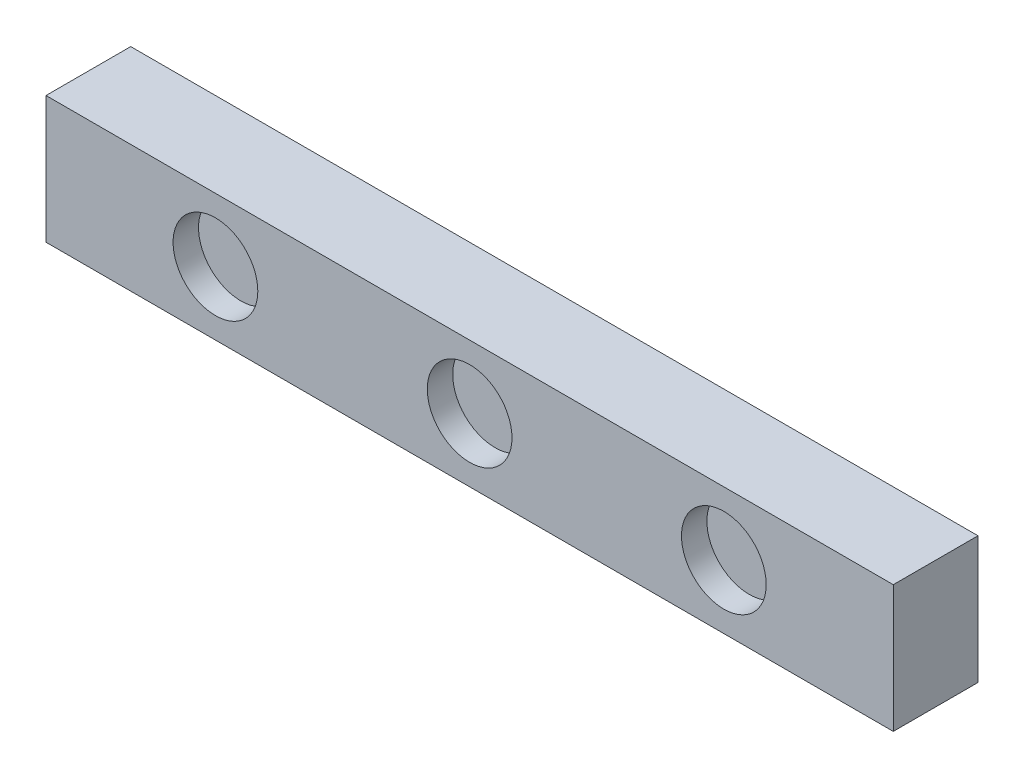
ISO-10303-21;
HEADER;
FILE_DESCRIPTION(('STEP AP214'),'2;1');
FILE_NAME('part.step','',(''),(''),'','','');
FILE_SCHEMA(('AUTOMOTIVE_DESIGN { 1 0 10303 214 1 1 1 1 }'));
ENDSEC;
DATA;
#1=APPLICATION_CONTEXT('core data for automotive mechanical design processes');
#2=APPLICATION_PROTOCOL_DEFINITION('international standard','automotive_design',2000,#1);
#3=PRODUCT_CONTEXT('',#1,'mechanical');
#4=PRODUCT('Part','Part','',(#3));
#5=PRODUCT_RELATED_PRODUCT_CATEGORY('part','',(#4));
#6=PRODUCT_DEFINITION_FORMATION('','',#4);
#7=PRODUCT_DEFINITION_CONTEXT('part definition',#1,'design');
#8=PRODUCT_DEFINITION('design','',#6,#7);
#9=PRODUCT_DEFINITION_SHAPE('','',#8);
#10=(LENGTH_UNIT() NAMED_UNIT(*) SI_UNIT(.MILLI.,.METRE.));
#11=(NAMED_UNIT(*) PLANE_ANGLE_UNIT() SI_UNIT($,.RADIAN.));
#12=(NAMED_UNIT(*) SI_UNIT($,.STERADIAN.) SOLID_ANGLE_UNIT());
#13=UNCERTAINTY_MEASURE_WITH_UNIT(LENGTH_MEASURE(1.E-05),#10,'distance_accuracy_value','');
#14=(GEOMETRIC_REPRESENTATION_CONTEXT(3) GLOBAL_UNCERTAINTY_ASSIGNED_CONTEXT((#13)) GLOBAL_UNIT_ASSIGNED_CONTEXT((#10,
#11,#12)) REPRESENTATION_CONTEXT('',''));
#15=CARTESIAN_POINT('',(0.,0.,0.));
#16=DIRECTION('',(0.,0.,1.));
#17=DIRECTION('',(1.,0.,0.));
#18=AXIS2_PLACEMENT_3D('',#15,#16,#17);
#19=CARTESIAN_POINT('',(500.,0.,-100.));
#20=DIRECTION('',(-1.,0.,0.));
#21=DIRECTION('',(0.,0.,1.));
#22=AXIS2_PLACEMENT_3D('',#19,#20,#21);
#23=PLANE('',#22);
#24=DIRECTION('',(0.,-1.,0.));
#25=VECTOR('',#24,1.);
#26=CARTESIAN_POINT('',(500.,0.,0.));
#27=LINE('',#26,#25);
#28=CARTESIAN_POINT('',(500.,75.,0.));
#29=VERTEX_POINT('',#28);
#30=CARTESIAN_POINT('',(500.,-75.,0.));
#31=VERTEX_POINT('',#30);
#32=EDGE_CURVE('E108',#29,#31,#27,.T.);
#33=ORIENTED_EDGE('',*,*,#32,.T.);
#34=DIRECTION('',(0.,0.,1.));
#35=VECTOR('',#34,1.);
#36=CARTESIAN_POINT('',(500.,-75.,-100.));
#37=LINE('',#36,#35);
#38=CARTESIAN_POINT('',(500.,-75.,-100.));
#39=VERTEX_POINT('',#38);
#40=EDGE_CURVE('E11',#39,#31,#37,.T.);
#41=ORIENTED_EDGE('',*,*,#40,.F.);
#42=DIRECTION('',(0.,-1.,0.));
#43=VECTOR('',#42,1.);
#44=CARTESIAN_POINT('',(500.,0.,-100.));
#45=LINE('',#44,#43);
#46=CARTESIAN_POINT('',(500.,75.,-100.));
#47=VERTEX_POINT('',#46);
#48=EDGE_CURVE('E60',#47,#39,#45,.T.);
#49=ORIENTED_EDGE('',*,*,#48,.F.);
#50=DIRECTION('',(0.,0.,1.));
#51=VECTOR('',#50,1.);
#52=CARTESIAN_POINT('',(500.,75.,-100.));
#53=LINE('',#52,#51);
#54=EDGE_CURVE('E44',#47,#29,#53,.T.);
#55=ORIENTED_EDGE('',*,*,#54,.T.);
#56=EDGE_LOOP('',(#33,#41,#49,#55));
#57=FACE_BOUND('',#56,.T.);
#58=ADVANCED_FACE('F41',(#57),#23,.F.);
#59=CARTESIAN_POINT('',(0.,-75.,-100.));
#60=DIRECTION('',(0.,-1.,0.));
#61=DIRECTION('',(0.,0.,-1.));
#62=AXIS2_PLACEMENT_3D('',#59,#60,#61);
#63=PLANE('',#62);
#64=DIRECTION('',(1.,0.,0.));
#65=VECTOR('',#64,1.);
#66=CARTESIAN_POINT('',(0.,-75.,0.));
#67=LINE('',#66,#65);
#68=CARTESIAN_POINT('',(-500.,-75.,0.));
#69=VERTEX_POINT('',#68);
#70=EDGE_CURVE('E117',#69,#31,#67,.T.);
#71=ORIENTED_EDGE('',*,*,#70,.F.);
#72=DIRECTION('',(0.,0.,1.));
#73=VECTOR('',#72,1.);
#74=CARTESIAN_POINT('',(-500.,-75.,-100.));
#75=LINE('',#74,#73);
#76=CARTESIAN_POINT('',(-500.,-75.,-100.));
#77=VERTEX_POINT('',#76);
#78=EDGE_CURVE('E51',#77,#69,#75,.T.);
#79=ORIENTED_EDGE('',*,*,#78,.F.);
#80=DIRECTION('',(1.,0.,0.));
#81=VECTOR('',#80,1.);
#82=CARTESIAN_POINT('',(0.,-75.,-100.));
#83=LINE('',#82,#81);
#84=EDGE_CURVE('E101',#77,#39,#83,.T.);
#85=ORIENTED_EDGE('',*,*,#84,.T.);
#86=ORIENTED_EDGE('',*,*,#40,.T.);
#87=EDGE_LOOP('',(#71,#79,#85,#86));
#88=FACE_BOUND('',#87,.T.);
#89=ADVANCED_FACE('F127',(#88),#63,.T.);
#90=CARTESIAN_POINT('',(-500.,0.,-100.));
#91=DIRECTION('',(-1.,0.,0.));
#92=DIRECTION('',(0.,0.,1.));
#93=AXIS2_PLACEMENT_3D('',#90,#91,#92);
#94=PLANE('',#93);
#95=DIRECTION('',(0.,-1.,0.));
#96=VECTOR('',#95,1.);
#97=CARTESIAN_POINT('',(-500.,0.,0.));
#98=LINE('',#97,#96);
#99=CARTESIAN_POINT('',(-500.,75.,0.));
#100=VERTEX_POINT('',#99);
#101=EDGE_CURVE('E92',#100,#69,#98,.T.);
#102=ORIENTED_EDGE('',*,*,#101,.F.);
#103=DIRECTION('',(0.,0.,1.));
#104=VECTOR('',#103,1.);
#105=CARTESIAN_POINT('',(-500.,75.,-100.));
#106=LINE('',#105,#104);
#107=CARTESIAN_POINT('',(-500.,75.,-100.));
#108=VERTEX_POINT('',#107);
#109=EDGE_CURVE('E89',#108,#100,#106,.T.);
#110=ORIENTED_EDGE('',*,*,#109,.F.);
#111=DIRECTION('',(0.,-1.,0.));
#112=VECTOR('',#111,1.);
#113=CARTESIAN_POINT('',(-500.,0.,-100.));
#114=LINE('',#113,#112);
#115=EDGE_CURVE('E91',#108,#77,#114,.T.);
#116=ORIENTED_EDGE('',*,*,#115,.T.);
#117=ORIENTED_EDGE('',*,*,#78,.T.);
#118=EDGE_LOOP('',(#102,#110,#116,#117));
#119=FACE_BOUND('',#118,.T.);
#120=ADVANCED_FACE('F90',(#119),#94,.T.);
#121=CARTESIAN_POINT('',(0.,75.,-100.));
#122=DIRECTION('',(0.,-1.,0.));
#123=DIRECTION('',(0.,0.,-1.));
#124=AXIS2_PLACEMENT_3D('',#121,#122,#123);
#125=PLANE('',#124);
#126=DIRECTION('',(1.,0.,0.));
#127=VECTOR('',#126,1.);
#128=CARTESIAN_POINT('',(0.,75.,0.));
#129=LINE('',#128,#127);
#130=EDGE_CURVE('E111',#100,#29,#129,.T.);
#131=ORIENTED_EDGE('',*,*,#130,.T.);
#132=ORIENTED_EDGE('',*,*,#54,.F.);
#133=DIRECTION('',(1.,0.,0.));
#134=VECTOR('',#133,1.);
#135=CARTESIAN_POINT('',(0.,75.,-100.));
#136=LINE('',#135,#134);
#137=EDGE_CURVE('E86',#108,#47,#136,.T.);
#138=ORIENTED_EDGE('',*,*,#137,.F.);
#139=ORIENTED_EDGE('',*,*,#109,.T.);
#140=EDGE_LOOP('',(#131,#132,#138,#139));
#141=FACE_BOUND('',#140,.T.);
#142=ADVANCED_FACE('F96',(#141),#125,.F.);
#143=CARTESIAN_POINT('',(0.,0.,-100.));
#144=DIRECTION('',(0.,0.,1.));
#145=DIRECTION('',(1.,0.,0.));
#146=AXIS2_PLACEMENT_3D('',#143,#144,#145);
#147=PLANE('',#146);
#148=ORIENTED_EDGE('',*,*,#48,.T.);
#149=ORIENTED_EDGE('',*,*,#84,.F.);
#150=ORIENTED_EDGE('',*,*,#115,.F.);
#151=ORIENTED_EDGE('',*,*,#137,.T.);
#152=EDGE_LOOP('',(#148,#149,#150,#151));
#153=FACE_BOUND('',#152,.T.);
#154=ADVANCED_FACE('F100',(#153),#147,.F.);
#155=CARTESIAN_POINT('',(0.,0.,0.));
#156=DIRECTION('',(0.,0.,1.));
#157=DIRECTION('',(1.,0.,0.));
#158=AXIS2_PLACEMENT_3D('',#155,#156,#157);
#159=PLANE('',#158);
#160=CARTESIAN_POINT('',(-300.,0.,0.));
#161=DIRECTION('',(0.,0.,1.));
#162=DIRECTION('',(1.,0.,0.));
#163=AXIS2_PLACEMENT_3D('',#160,#161,#162);
#164=CIRCLE('',#163,50.);
#165=CARTESIAN_POINT('',(-250.,0.,0.));
#166=VERTEX_POINT('',#165);
#167=EDGE_CURVE('E174',#166,#166,#164,.T.);
#168=ORIENTED_EDGE('',*,*,#167,.F.);
#169=EDGE_LOOP('',(#168));
#170=FACE_BOUND('',#169,.T.);
#171=CARTESIAN_POINT('',(300.,0.,0.));
#172=DIRECTION('',(0.,0.,1.));
#173=DIRECTION('',(1.,0.,0.));
#174=AXIS2_PLACEMENT_3D('',#171,#172,#173);
#175=CIRCLE('',#174,50.);
#176=CARTESIAN_POINT('',(350.,0.,0.));
#177=VERTEX_POINT('',#176);
#178=EDGE_CURVE('E178',#177,#177,#175,.T.);
#179=ORIENTED_EDGE('',*,*,#178,.F.);
#180=EDGE_LOOP('',(#179));
#181=FACE_BOUND('',#180,.T.);
#182=CARTESIAN_POINT('',(0.,0.,0.));
#183=DIRECTION('',(0.,0.,1.));
#184=DIRECTION('',(1.,0.,0.));
#185=AXIS2_PLACEMENT_3D('',#182,#183,#184);
#186=CIRCLE('',#185,50.);
#187=CARTESIAN_POINT('',(50.,0.,0.));
#188=VERTEX_POINT('',#187);
#189=EDGE_CURVE('E188',#188,#188,#186,.T.);
#190=ORIENTED_EDGE('',*,*,#189,.F.);
#191=EDGE_LOOP('',(#190));
#192=FACE_BOUND('',#191,.T.);
#193=ORIENTED_EDGE('',*,*,#32,.F.);
#194=ORIENTED_EDGE('',*,*,#130,.F.);
#195=ORIENTED_EDGE('',*,*,#101,.T.);
#196=ORIENTED_EDGE('',*,*,#70,.T.);
#197=EDGE_LOOP('',(#193,#194,#195,#196));
#198=FACE_BOUND('',#197,.T.);
#199=ADVANCED_FACE('F126',(#170,#181,#192,#198),#159,.T.);
#200=CARTESIAN_POINT('',(0.,0.,-30.));
#201=DIRECTION('',(0.,0.,1.));
#202=DIRECTION('',(1.,0.,0.));
#203=AXIS2_PLACEMENT_3D('',#200,#201,#202);
#204=CYLINDRICAL_SURFACE('',#203,50.);
#205=CARTESIAN_POINT('',(0.,0.,-30.));
#206=DIRECTION('',(0.,0.,1.));
#207=DIRECTION('',(1.,0.,0.));
#208=AXIS2_PLACEMENT_3D('',#205,#206,#207);
#209=CIRCLE('',#208,50.);
#210=CARTESIAN_POINT('',(50.,0.,-30.));
#211=VERTEX_POINT('',#210);
#212=EDGE_CURVE('E192',#211,#211,#209,.T.);
#213=ORIENTED_EDGE('',*,*,#212,.F.);
#214=EDGE_LOOP('',(#213));
#215=FACE_BOUND('',#214,.T.);
#216=ORIENTED_EDGE('',*,*,#189,.T.);
#217=EDGE_LOOP('',(#216));
#218=FACE_BOUND('',#217,.T.);
#219=ADVANCED_FACE('F144',(#215,#218),#204,.F.);
#220=CARTESIAN_POINT('',(0.,0.,-30.));
#221=DIRECTION('',(0.,0.,1.));
#222=DIRECTION('',(1.,0.,0.));
#223=AXIS2_PLACEMENT_3D('',#220,#221,#222);
#224=PLANE('',#223);
#225=ORIENTED_EDGE('',*,*,#212,.T.);
#226=EDGE_LOOP('',(#225));
#227=FACE_BOUND('',#226,.T.);
#228=ADVANCED_FACE('F147',(#227),#224,.T.);
#229=CARTESIAN_POINT('',(300.,0.,-30.));
#230=DIRECTION('',(0.,0.,1.));
#231=DIRECTION('',(1.,0.,0.));
#232=AXIS2_PLACEMENT_3D('',#229,#230,#231);
#233=CYLINDRICAL_SURFACE('',#232,50.);
#234=CARTESIAN_POINT('',(300.,0.,-30.));
#235=DIRECTION('',(0.,0.,1.));
#236=DIRECTION('',(1.,0.,0.));
#237=AXIS2_PLACEMENT_3D('',#234,#235,#236);
#238=CIRCLE('',#237,50.);
#239=CARTESIAN_POINT('',(350.,0.,-30.));
#240=VERTEX_POINT('',#239);
#241=EDGE_CURVE('E184',#240,#240,#238,.T.);
#242=ORIENTED_EDGE('',*,*,#241,.F.);
#243=EDGE_LOOP('',(#242));
#244=FACE_BOUND('',#243,.T.);
#245=ORIENTED_EDGE('',*,*,#178,.T.);
#246=EDGE_LOOP('',(#245));
#247=FACE_BOUND('',#246,.T.);
#248=ADVANCED_FACE('F150',(#244,#247),#233,.F.);
#249=CARTESIAN_POINT('',(0.,0.,-30.));
#250=DIRECTION('',(0.,0.,1.));
#251=DIRECTION('',(1.,0.,0.));
#252=AXIS2_PLACEMENT_3D('',#249,#250,#251);
#253=PLANE('',#252);
#254=ORIENTED_EDGE('',*,*,#241,.T.);
#255=EDGE_LOOP('',(#254));
#256=FACE_BOUND('',#255,.T.);
#257=ADVANCED_FACE('F155',(#256),#253,.T.);
#258=CARTESIAN_POINT('',(-300.,0.,-30.));
#259=DIRECTION('',(0.,0.,1.));
#260=DIRECTION('',(1.,0.,0.));
#261=AXIS2_PLACEMENT_3D('',#258,#259,#260);
#262=CYLINDRICAL_SURFACE('',#261,50.);
#263=CARTESIAN_POINT('',(-300.,0.,-30.));
#264=DIRECTION('',(0.,0.,1.));
#265=DIRECTION('',(1.,0.,0.));
#266=AXIS2_PLACEMENT_3D('',#263,#264,#265);
#267=CIRCLE('',#266,50.);
#268=CARTESIAN_POINT('',(-250.,0.,-30.));
#269=VERTEX_POINT('',#268);
#270=EDGE_CURVE('E112',#269,#269,#267,.T.);
#271=ORIENTED_EDGE('',*,*,#270,.F.);
#272=EDGE_LOOP('',(#271));
#273=FACE_BOUND('',#272,.T.);
#274=ORIENTED_EDGE('',*,*,#167,.T.);
#275=EDGE_LOOP('',(#274));
#276=FACE_BOUND('',#275,.T.);
#277=ADVANCED_FACE('F158',(#273,#276),#262,.F.);
#278=CARTESIAN_POINT('',(0.,0.,-30.));
#279=DIRECTION('',(0.,0.,1.));
#280=DIRECTION('',(1.,0.,0.));
#281=AXIS2_PLACEMENT_3D('',#278,#279,#280);
#282=PLANE('',#281);
#283=ORIENTED_EDGE('',*,*,#270,.T.);
#284=EDGE_LOOP('',(#283));
#285=FACE_BOUND('',#284,.T.);
#286=ADVANCED_FACE('F165',(#285),#282,.T.);
#287=CLOSED_SHELL('',(#58,#89,#120,#142,#154,#199,#219,#228,#248,#257,#277,#286));
#288=MANIFOLD_SOLID_BREP('B2',#287);
#289=ADVANCED_BREP_SHAPE_REPRESENTATION('',(#18,#288),#14);
#290=SHAPE_DEFINITION_REPRESENTATION(#9,#289);
ENDSEC;
END-ISO-10303-21;
